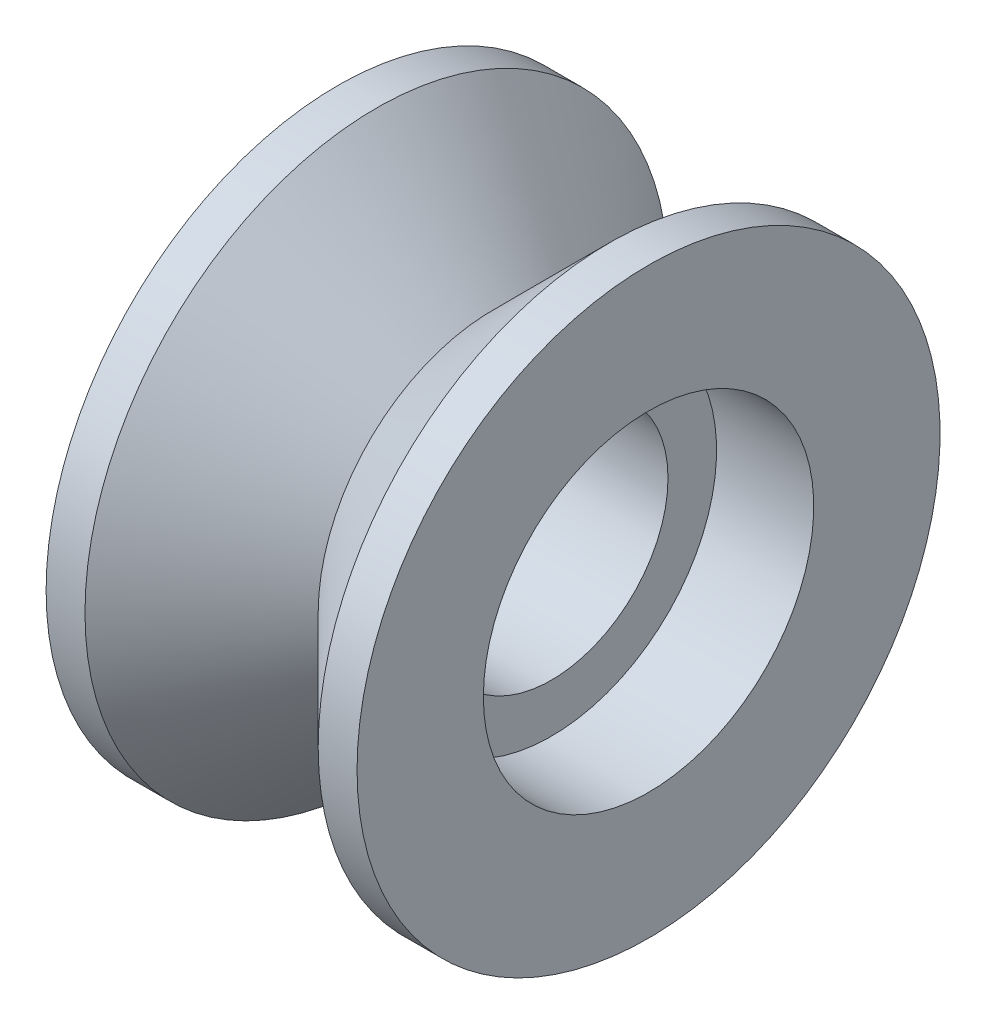
ISO-10303-21;
HEADER;
FILE_DESCRIPTION(('STEP AP214'),'2;1');
FILE_NAME('part.step','',(''),(''),'','','');
FILE_SCHEMA(('AUTOMOTIVE_DESIGN { 1 0 10303 214 1 1 1 1 }'));
ENDSEC;
DATA;
#1=APPLICATION_CONTEXT('core data for automotive mechanical design processes');
#2=APPLICATION_PROTOCOL_DEFINITION('international standard','automotive_design',2000,#1);
#3=PRODUCT_CONTEXT('',#1,'mechanical');
#4=PRODUCT('Part','Part','',(#3));
#5=PRODUCT_RELATED_PRODUCT_CATEGORY('part','',(#4));
#6=PRODUCT_DEFINITION_FORMATION('','',#4);
#7=PRODUCT_DEFINITION_CONTEXT('part definition',#1,'design');
#8=PRODUCT_DEFINITION('design','',#6,#7);
#9=PRODUCT_DEFINITION_SHAPE('','',#8);
#10=(LENGTH_UNIT() NAMED_UNIT(*) SI_UNIT(.MILLI.,.METRE.));
#11=(NAMED_UNIT(*) PLANE_ANGLE_UNIT() SI_UNIT($,.RADIAN.));
#12=(NAMED_UNIT(*) SI_UNIT($,.STERADIAN.) SOLID_ANGLE_UNIT());
#13=UNCERTAINTY_MEASURE_WITH_UNIT(LENGTH_MEASURE(1.E-05),#10,'distance_accuracy_value','');
#14=(GEOMETRIC_REPRESENTATION_CONTEXT(3) GLOBAL_UNCERTAINTY_ASSIGNED_CONTEXT((#13)) GLOBAL_UNIT_ASSIGNED_CONTEXT((#10,
#11,#12)) REPRESENTATION_CONTEXT('',''));
#15=CARTESIAN_POINT('',(0.,0.,0.));
#16=DIRECTION('',(0.,0.,1.));
#17=DIRECTION('',(1.,0.,0.));
#18=AXIS2_PLACEMENT_3D('',#15,#16,#17);
#19=CARTESIAN_POINT('',(0.,15.,0.));
#20=DIRECTION('',(1.,0.,0.));
#21=DIRECTION('',(0.,0.,-1.));
#22=AXIS2_PLACEMENT_3D('',#19,#20,#21);
#23=PLANE('',#22);
#24=CARTESIAN_POINT('',(0.,0.,0.));
#25=DIRECTION('',(-1.,0.,0.));
#26=DIRECTION('',(0.,0.,1.));
#27=AXIS2_PLACEMENT_3D('',#24,#25,#26);
#28=CIRCLE('',#27,8.5);
#29=CARTESIAN_POINT('',(0.,0.,8.5));
#30=VERTEX_POINT('',#29);
#31=EDGE_CURVE('E10',#30,#30,#28,.T.);
#32=ORIENTED_EDGE('',*,*,#31,.F.);
#33=EDGE_LOOP('',(#32));
#34=FACE_BOUND('',#33,.T.);
#35=CARTESIAN_POINT('',(0.,0.,0.));
#36=DIRECTION('',(-1.,0.,0.));
#37=DIRECTION('',(0.,0.,1.));
#38=AXIS2_PLACEMENT_3D('',#35,#36,#37);
#39=CIRCLE('',#38,15.);
#40=CARTESIAN_POINT('',(0.,0.,15.));
#41=VERTEX_POINT('',#40);
#42=EDGE_CURVE('E67',#41,#41,#39,.T.);
#43=ORIENTED_EDGE('',*,*,#42,.T.);
#44=EDGE_LOOP('',(#43));
#45=FACE_BOUND('',#44,.T.);
#46=ADVANCED_FACE('F30',(#34,#45),#23,.F.);
#47=CARTESIAN_POINT('',(0.,0.,0.));
#48=DIRECTION('',(-1.,0.,0.));
#49=DIRECTION('',(0.,0.,1.));
#50=AXIS2_PLACEMENT_3D('',#47,#48,#49);
#51=CYLINDRICAL_SURFACE('',#50,8.5);
#52=CARTESIAN_POINT('',(5.,0.,0.));
#53=DIRECTION('',(-1.,0.,0.));
#54=DIRECTION('',(0.,0.,1.));
#55=AXIS2_PLACEMENT_3D('',#52,#53,#54);
#56=CIRCLE('',#55,8.5);
#57=CARTESIAN_POINT('',(5.,0.,8.5));
#58=VERTEX_POINT('',#57);
#59=EDGE_CURVE('E36',#58,#58,#56,.T.);
#60=ORIENTED_EDGE('',*,*,#59,.F.);
#61=EDGE_LOOP('',(#60));
#62=FACE_BOUND('',#61,.T.);
#63=ORIENTED_EDGE('',*,*,#31,.T.);
#64=EDGE_LOOP('',(#63));
#65=FACE_BOUND('',#64,.T.);
#66=ADVANCED_FACE('F122',(#62,#65),#51,.F.);
#67=CARTESIAN_POINT('',(5.,8.5,0.));
#68=DIRECTION('',(1.,0.,0.));
#69=DIRECTION('',(0.,0.,-1.));
#70=AXIS2_PLACEMENT_3D('',#67,#68,#69);
#71=PLANE('',#70);
#72=CARTESIAN_POINT('',(5.,0.,0.));
#73=DIRECTION('',(-1.,0.,0.));
#74=DIRECTION('',(0.,0.,1.));
#75=AXIS2_PLACEMENT_3D('',#72,#73,#74);
#76=CIRCLE('',#75,6.);
#77=CARTESIAN_POINT('',(5.,0.,6.));
#78=VERTEX_POINT('',#77);
#79=EDGE_CURVE('E40',#78,#78,#76,.T.);
#80=ORIENTED_EDGE('',*,*,#79,.F.);
#81=EDGE_LOOP('',(#80));
#82=FACE_BOUND('',#81,.T.);
#83=ORIENTED_EDGE('',*,*,#59,.T.);
#84=EDGE_LOOP('',(#83));
#85=FACE_BOUND('',#84,.T.);
#86=ADVANCED_FACE('F117',(#82,#85),#71,.F.);
#87=CARTESIAN_POINT('',(0.,0.,0.));
#88=DIRECTION('',(-1.,0.,0.));
#89=DIRECTION('',(0.,0.,1.));
#90=AXIS2_PLACEMENT_3D('',#87,#88,#89);
#91=CYLINDRICAL_SURFACE('',#90,6.);
#92=CARTESIAN_POINT('',(11.,0.,0.));
#93=DIRECTION('',(-1.,0.,0.));
#94=DIRECTION('',(0.,0.,1.));
#95=AXIS2_PLACEMENT_3D('',#92,#93,#94);
#96=CIRCLE('',#95,6.);
#97=CARTESIAN_POINT('',(11.,0.,6.));
#98=VERTEX_POINT('',#97);
#99=EDGE_CURVE('E44',#98,#98,#96,.T.);
#100=ORIENTED_EDGE('',*,*,#99,.F.);
#101=EDGE_LOOP('',(#100));
#102=FACE_BOUND('',#101,.T.);
#103=ORIENTED_EDGE('',*,*,#79,.T.);
#104=EDGE_LOOP('',(#103));
#105=FACE_BOUND('',#104,.T.);
#106=ADVANCED_FACE('F111',(#102,#105),#91,.F.);
#107=CARTESIAN_POINT('',(11.,8.5,0.));
#108=DIRECTION('',(-1.,0.,0.));
#109=DIRECTION('',(0.,0.,1.));
#110=AXIS2_PLACEMENT_3D('',#107,#108,#109);
#111=PLANE('',#110);
#112=CARTESIAN_POINT('',(11.,0.,0.));
#113=DIRECTION('',(-1.,0.,0.));
#114=DIRECTION('',(0.,0.,1.));
#115=AXIS2_PLACEMENT_3D('',#112,#113,#114);
#116=CIRCLE('',#115,8.5);
#117=CARTESIAN_POINT('',(11.,0.,8.5));
#118=VERTEX_POINT('',#117);
#119=EDGE_CURVE('E49',#118,#118,#116,.T.);
#120=ORIENTED_EDGE('',*,*,#119,.F.);
#121=EDGE_LOOP('',(#120));
#122=FACE_BOUND('',#121,.T.);
#123=ORIENTED_EDGE('',*,*,#99,.T.);
#124=EDGE_LOOP('',(#123));
#125=FACE_BOUND('',#124,.T.);
#126=ADVANCED_FACE('F105',(#122,#125),#111,.F.);
#127=CARTESIAN_POINT('',(0.,0.,0.));
#128=DIRECTION('',(-1.,0.,0.));
#129=DIRECTION('',(0.,0.,1.));
#130=AXIS2_PLACEMENT_3D('',#127,#128,#129);
#131=CYLINDRICAL_SURFACE('',#130,8.5);
#132=CARTESIAN_POINT('',(16.,0.,0.));
#133=DIRECTION('',(-1.,0.,0.));
#134=DIRECTION('',(0.,0.,1.));
#135=AXIS2_PLACEMENT_3D('',#132,#133,#134);
#136=CIRCLE('',#135,8.5);
#137=CARTESIAN_POINT('',(16.,0.,8.5));
#138=VERTEX_POINT('',#137);
#139=EDGE_CURVE('E52',#138,#138,#136,.T.);
#140=ORIENTED_EDGE('',*,*,#139,.F.);
#141=EDGE_LOOP('',(#140));
#142=FACE_BOUND('',#141,.T.);
#143=ORIENTED_EDGE('',*,*,#119,.T.);
#144=EDGE_LOOP('',(#143));
#145=FACE_BOUND('',#144,.T.);
#146=ADVANCED_FACE('F99',(#142,#145),#131,.F.);
#147=CARTESIAN_POINT('',(16.,15.,0.));
#148=DIRECTION('',(-1.,0.,0.));
#149=DIRECTION('',(0.,0.,1.));
#150=AXIS2_PLACEMENT_3D('',#147,#148,#149);
#151=PLANE('',#150);
#152=CARTESIAN_POINT('',(16.,0.,0.));
#153=DIRECTION('',(-1.,0.,0.));
#154=DIRECTION('',(0.,0.,1.));
#155=AXIS2_PLACEMENT_3D('',#152,#153,#154);
#156=CIRCLE('',#155,15.);
#157=CARTESIAN_POINT('',(16.,0.,15.));
#158=VERTEX_POINT('',#157);
#159=EDGE_CURVE('E55',#158,#158,#156,.T.);
#160=ORIENTED_EDGE('',*,*,#159,.F.);
#161=EDGE_LOOP('',(#160));
#162=FACE_BOUND('',#161,.T.);
#163=ORIENTED_EDGE('',*,*,#139,.T.);
#164=EDGE_LOOP('',(#163));
#165=FACE_BOUND('',#164,.T.);
#166=ADVANCED_FACE('F93',(#162,#165),#151,.F.);
#167=CARTESIAN_POINT('',(0.,0.,0.));
#168=DIRECTION('',(-1.,0.,0.));
#169=DIRECTION('',(0.,0.,1.));
#170=AXIS2_PLACEMENT_3D('',#167,#168,#169);
#171=CYLINDRICAL_SURFACE('',#170,15.);
#172=CARTESIAN_POINT('',(14.,0.,0.));
#173=DIRECTION('',(-1.,0.,0.));
#174=DIRECTION('',(0.,0.,1.));
#175=AXIS2_PLACEMENT_3D('',#172,#173,#174);
#176=CIRCLE('',#175,15.);
#177=CARTESIAN_POINT('',(14.,0.,15.));
#178=VERTEX_POINT('',#177);
#179=EDGE_CURVE('E58',#178,#178,#176,.T.);
#180=ORIENTED_EDGE('',*,*,#179,.F.);
#181=EDGE_LOOP('',(#180));
#182=FACE_BOUND('',#181,.T.);
#183=ORIENTED_EDGE('',*,*,#159,.T.);
#184=EDGE_LOOP('',(#183));
#185=FACE_BOUND('',#184,.T.);
#186=ADVANCED_FACE('F87',(#182,#185),#171,.T.);
#187=CARTESIAN_POINT('',(14.,0.,0.));
#188=DIRECTION('',(1.,0.,0.));
#189=DIRECTION('',(0.,0.,-1.));
#190=AXIS2_PLACEMENT_3D('',#187,#188,#189);
#191=CONICAL_SURFACE('',#190,15.,0.785398163397446);
#192=CARTESIAN_POINT('',(8.,0.,0.));
#193=DIRECTION('',(-1.,0.,0.));
#194=DIRECTION('',(0.,0.,1.));
#195=AXIS2_PLACEMENT_3D('',#192,#193,#194);
#196=CIRCLE('',#195,9.00000000000002);
#197=CARTESIAN_POINT('',(8.,0.,9.00000000000002));
#198=VERTEX_POINT('',#197);
#199=EDGE_CURVE('E61',#198,#198,#196,.T.);
#200=ORIENTED_EDGE('',*,*,#199,.F.);
#201=EDGE_LOOP('',(#200));
#202=FACE_BOUND('',#201,.T.);
#203=ORIENTED_EDGE('',*,*,#179,.T.);
#204=EDGE_LOOP('',(#203));
#205=FACE_BOUND('',#204,.T.);
#206=ADVANCED_FACE('F81',(#202,#205),#191,.T.);
#207=CARTESIAN_POINT('',(8.,0.,0.));
#208=DIRECTION('',(-1.,0.,0.));
#209=DIRECTION('',(0.,0.,1.));
#210=AXIS2_PLACEMENT_3D('',#207,#208,#209);
#211=CONICAL_SURFACE('',#210,9.00000000000002,0.785398163397446);
#212=CARTESIAN_POINT('',(2.,0.,0.));
#213=DIRECTION('',(-1.,0.,0.));
#214=DIRECTION('',(0.,0.,1.));
#215=AXIS2_PLACEMENT_3D('',#212,#213,#214);
#216=CIRCLE('',#215,15.);
#217=CARTESIAN_POINT('',(2.,0.,15.));
#218=VERTEX_POINT('',#217);
#219=EDGE_CURVE('E64',#218,#218,#216,.T.);
#220=ORIENTED_EDGE('',*,*,#219,.F.);
#221=EDGE_LOOP('',(#220));
#222=FACE_BOUND('',#221,.T.);
#223=ORIENTED_EDGE('',*,*,#199,.T.);
#224=EDGE_LOOP('',(#223));
#225=FACE_BOUND('',#224,.T.);
#226=ADVANCED_FACE('F75',(#222,#225),#211,.T.);
#227=CARTESIAN_POINT('',(0.,0.,0.));
#228=DIRECTION('',(-1.,0.,0.));
#229=DIRECTION('',(0.,0.,1.));
#230=AXIS2_PLACEMENT_3D('',#227,#228,#229);
#231=CYLINDRICAL_SURFACE('',#230,15.);
#232=ORIENTED_EDGE('',*,*,#42,.F.);
#233=EDGE_LOOP('',(#232));
#234=FACE_BOUND('',#233,.T.);
#235=ORIENTED_EDGE('',*,*,#219,.T.);
#236=EDGE_LOOP('',(#235));
#237=FACE_BOUND('',#236,.T.);
#238=ADVANCED_FACE('F72',(#234,#237),#231,.T.);
#239=CLOSED_SHELL('',(#46,#66,#86,#106,#126,#146,#166,#186,#206,#226,#238));
#240=MANIFOLD_SOLID_BREP('B2',#239);
#241=ADVANCED_BREP_SHAPE_REPRESENTATION('',(#18,#240),#14);
#242=SHAPE_DEFINITION_REPRESENTATION(#9,#241);
ENDSEC;
END-ISO-10303-21;
